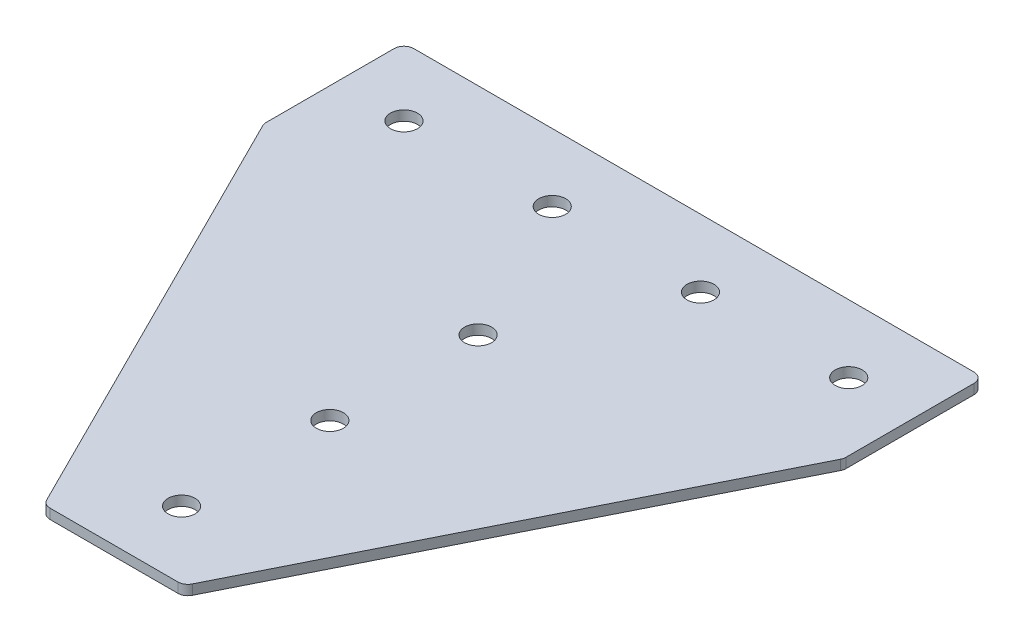
ISO-10303-21;
HEADER;
FILE_DESCRIPTION(('STEP AP214'),'2;1');
FILE_NAME('part.step','',(''),(''),'','','');
FILE_SCHEMA(('AUTOMOTIVE_DESIGN { 1 0 10303 214 1 1 1 1 }'));
ENDSEC;
DATA;
#1=APPLICATION_CONTEXT('core data for automotive mechanical design processes');
#2=APPLICATION_PROTOCOL_DEFINITION('international standard','automotive_design',2000,#1);
#3=PRODUCT_CONTEXT('',#1,'mechanical');
#4=PRODUCT('Part','Part','',(#3));
#5=PRODUCT_RELATED_PRODUCT_CATEGORY('part','',(#4));
#6=PRODUCT_DEFINITION_FORMATION('','',#4);
#7=PRODUCT_DEFINITION_CONTEXT('part definition',#1,'design');
#8=PRODUCT_DEFINITION('design','',#6,#7);
#9=PRODUCT_DEFINITION_SHAPE('','',#8);
#10=(LENGTH_UNIT() NAMED_UNIT(*) SI_UNIT(.MILLI.,.METRE.));
#11=(NAMED_UNIT(*) PLANE_ANGLE_UNIT() SI_UNIT($,.RADIAN.));
#12=(NAMED_UNIT(*) SI_UNIT($,.STERADIAN.) SOLID_ANGLE_UNIT());
#13=UNCERTAINTY_MEASURE_WITH_UNIT(LENGTH_MEASURE(1.E-05),#10,'distance_accuracy_value','');
#14=(GEOMETRIC_REPRESENTATION_CONTEXT(3) GLOBAL_UNCERTAINTY_ASSIGNED_CONTEXT((#13)) GLOBAL_UNIT_ASSIGNED_CONTEXT((#10,
#11,#12)) REPRESENTATION_CONTEXT('',''));
#15=CARTESIAN_POINT('',(0.,0.,0.));
#16=DIRECTION('',(0.,0.,1.));
#17=DIRECTION('',(1.,0.,0.));
#18=AXIS2_PLACEMENT_3D('',#15,#16,#17);
#19=CARTESIAN_POINT('',(-1.93702400832763,1.42462627726309,-68.4871269738255));
#20=DIRECTION('',(0.,-1.,0.));
#21=DIRECTION('',(0.,0.,-1.));
#22=AXIS2_PLACEMENT_3D('',#19,#20,#21);
#23=PLANE('',#22);
#24=CARTESIAN_POINT('',(-1.93702400832764,1.42462627726309,-23.4871269738255));
#25=DIRECTION('',(0.,1.,0.));
#26=DIRECTION('',(0.,0.,1.));
#27=AXIS2_PLACEMENT_3D('',#24,#25,#26);
#28=CIRCLE('',#27,4.1);
#29=CARTESIAN_POINT('',(-1.93702400832764,1.42462627726309,-19.3871269738255));
#30=VERTEX_POINT('',#29);
#31=EDGE_CURVE('E183',#30,#30,#28,.T.);
#32=ORIENTED_EDGE('',*,*,#31,.T.);
#33=EDGE_LOOP('',(#32));
#34=FACE_BOUND('',#33,.T.);
#35=DIRECTION('',(1.,0.,0.));
#36=VECTOR('',#35,1.);
#37=CARTESIAN_POINT('',(-22.4370240083276,1.42462627726309,87.0128730261745));
#38=LINE('',#37,#36);
#39=CARTESIAN_POINT('',(-21.3468540645781,1.42462627726309,87.0128730261745));
#40=VERTEX_POINT('',#39);
#41=CARTESIAN_POINT('',(17.4728060479229,1.42462627726309,87.0128730261745));
#42=VERTEX_POINT('',#41);
#43=EDGE_CURVE('E201',#40,#42,#38,.T.);
#44=ORIENTED_EDGE('',*,*,#43,.F.);
#45=CARTESIAN_POINT('',(-21.3468540645781,1.42462627726309,84.0128730261745));
#46=DIRECTION('',(0.,1.,0.));
#47=DIRECTION('',(0.,0.,-1.));
#48=AXIS2_PLACEMENT_3D('',#45,#46,#47);
#49=CIRCLE('',#48,3.);
#50=CARTESIAN_POINT('',(-24.0301356375779,1.42462627726309,85.3545138126744));
#51=VERTEX_POINT('',#50);
#52=EDGE_CURVE('E155',#51,#40,#49,.T.);
#53=ORIENTED_EDGE('',*,*,#52,.F.);
#54=DIRECTION('',(-0.447213595499958,0.,-0.894427190999916));
#55=VECTOR('',#54,1.);
#56=CARTESIAN_POINT('',(-23.2009560308278,1.42462627726309,87.0128730261745));
#57=LINE('',#56,#55);
#58=CARTESIAN_POINT('',(-89.6203055813274,1.42462627726309,-45.8258260748245));
#59=VERTEX_POINT('',#58);
#60=EDGE_CURVE('E142',#51,#59,#57,.T.);
#61=ORIENTED_EDGE('',*,*,#60,.T.);
#62=CARTESIAN_POINT('',(-86.9370240083276,1.42462627726309,-47.1674668613244));
#63=DIRECTION('',(0.,1.,0.));
#64=DIRECTION('',(0.,0.,-1.));
#65=AXIS2_PLACEMENT_3D('',#62,#63,#64);
#66=CIRCLE('',#65,3.);
#67=CARTESIAN_POINT('',(-89.9370240083277,1.42462627726309,-47.1674668613244));
#68=VERTEX_POINT('',#67);
#69=EDGE_CURVE('E153',#68,#59,#66,.T.);
#70=ORIENTED_EDGE('',*,*,#69,.F.);
#71=DIRECTION('',(0.,0.,-1.));
#72=VECTOR('',#71,1.);
#73=CARTESIAN_POINT('',(-89.9370240083277,1.42462627726309,-46.4592629288251));
#74=LINE('',#73,#72);
#75=CARTESIAN_POINT('',(-89.9370240083277,1.42462627726309,-85.9871269738255));
#76=VERTEX_POINT('',#75);
#77=EDGE_CURVE('E124',#68,#76,#74,.T.);
#78=ORIENTED_EDGE('',*,*,#77,.T.);
#79=CARTESIAN_POINT('',(-86.9370240083276,1.42462627726309,-85.9871269738255));
#80=DIRECTION('',(0.,1.,0.));
#81=DIRECTION('',(0.,0.,-1.));
#82=AXIS2_PLACEMENT_3D('',#79,#80,#81);
#83=CIRCLE('',#82,3.);
#84=CARTESIAN_POINT('',(-86.9370240083276,1.42462627726309,-88.9871269738255));
#85=VERTEX_POINT('',#84);
#86=EDGE_CURVE('E150',#85,#76,#83,.T.);
#87=ORIENTED_EDGE('',*,*,#86,.F.);
#88=DIRECTION('',(-1.,0.,0.));
#89=VECTOR('',#88,1.);
#90=CARTESIAN_POINT('',(86.0629759916724,1.42462627726309,-88.9871269738255));
#91=LINE('',#90,#89);
#92=CARTESIAN_POINT('',(83.0629759916724,1.42462627726309,-88.9871269738255));
#93=VERTEX_POINT('',#92);
#94=EDGE_CURVE('E198',#93,#85,#91,.T.);
#95=ORIENTED_EDGE('',*,*,#94,.F.);
#96=CARTESIAN_POINT('',(83.0629759916724,1.42462627726309,-85.9871269738255));
#97=DIRECTION('',(0.,-1.,0.));
#98=DIRECTION('',(0.,0.,-1.));
#99=AXIS2_PLACEMENT_3D('',#96,#97,#98);
#100=CIRCLE('',#99,3.);
#101=CARTESIAN_POINT('',(86.0629759916724,1.42462627726309,-85.9871269738255));
#102=VERTEX_POINT('',#101);
#103=EDGE_CURVE('E222',#93,#102,#100,.T.);
#104=ORIENTED_EDGE('',*,*,#103,.T.);
#105=DIRECTION('',(0.,0.,-1.));
#106=VECTOR('',#105,1.);
#107=CARTESIAN_POINT('',(86.0629759916724,1.42462627726309,-46.4592629288251));
#108=LINE('',#107,#106);
#109=CARTESIAN_POINT('',(86.0629759916724,1.42462627726309,-47.1674668613244));
#110=VERTEX_POINT('',#109);
#111=EDGE_CURVE('E195',#110,#102,#108,.T.);
#112=ORIENTED_EDGE('',*,*,#111,.F.);
#113=CARTESIAN_POINT('',(83.0629759916724,1.42462627726309,-47.1674668613244));
#114=DIRECTION('',(0.,-1.,0.));
#115=DIRECTION('',(0.,0.,-1.));
#116=AXIS2_PLACEMENT_3D('',#113,#114,#115);
#117=CIRCLE('',#116,3.);
#118=CARTESIAN_POINT('',(85.7462575646721,1.42462627726309,-45.8258260748245));
#119=VERTEX_POINT('',#118);
#120=EDGE_CURVE('E31',#110,#119,#117,.T.);
#121=ORIENTED_EDGE('',*,*,#120,.T.);
#122=DIRECTION('',(0.447213595499958,0.,-0.894427190999916));
#123=VECTOR('',#122,1.);
#124=CARTESIAN_POINT('',(19.3269080141726,1.42462627726309,87.0128730261745));
#125=LINE('',#124,#123);
#126=CARTESIAN_POINT('',(20.1560876209226,1.42462627726309,85.3545138126744));
#127=VERTEX_POINT('',#126);
#128=EDGE_CURVE('E203',#127,#119,#125,.T.);
#129=ORIENTED_EDGE('',*,*,#128,.F.);
#130=CARTESIAN_POINT('',(17.4728060479229,1.42462627726309,84.0128730261745));
#131=DIRECTION('',(0.,-1.,0.));
#132=DIRECTION('',(0.,0.,-1.));
#133=AXIS2_PLACEMENT_3D('',#130,#131,#132);
#134=CIRCLE('',#133,3.);
#135=EDGE_CURVE('E225',#127,#42,#134,.T.);
#136=ORIENTED_EDGE('',*,*,#135,.T.);
#137=EDGE_LOOP('',(#44,#53,#61,#70,#78,#87,#95,#104,#112,#121,#129,#136));
#138=FACE_BOUND('',#137,.T.);
#139=CARTESIAN_POINT('',(-1.93702400832764,1.42462627726309,66.5128730261745));
#140=DIRECTION('',(0.,1.,0.));
#141=DIRECTION('',(0.,0.,1.));
#142=AXIS2_PLACEMENT_3D('',#139,#140,#141);
#143=CIRCLE('',#142,4.1);
#144=CARTESIAN_POINT('',(-1.93702400832764,1.42462627726309,70.6128730261745));
#145=VERTEX_POINT('',#144);
#146=EDGE_CURVE('E171',#145,#145,#143,.T.);
#147=ORIENTED_EDGE('',*,*,#146,.T.);
#148=EDGE_LOOP('',(#147));
#149=FACE_BOUND('',#148,.T.);
#150=CARTESIAN_POINT('',(-1.93702400832764,1.42462627726309,21.5128730261745));
#151=DIRECTION('',(0.,1.,0.));
#152=DIRECTION('',(0.,0.,1.));
#153=AXIS2_PLACEMENT_3D('',#150,#151,#152);
#154=CIRCLE('',#153,4.1);
#155=CARTESIAN_POINT('',(-1.93702400832764,1.42462627726309,25.6128730261745));
#156=VERTEX_POINT('',#155);
#157=EDGE_CURVE('E177',#156,#156,#154,.T.);
#158=ORIENTED_EDGE('',*,*,#157,.T.);
#159=EDGE_LOOP('',(#158));
#160=FACE_BOUND('',#159,.T.);
#161=CARTESIAN_POINT('',(65.5629759916724,1.42462627726309,-68.4871269738255));
#162=DIRECTION('',(0.,1.,0.));
#163=DIRECTION('',(0.,0.,1.));
#164=AXIS2_PLACEMENT_3D('',#161,#162,#163);
#165=CIRCLE('',#164,4.09999999999999);
#166=CARTESIAN_POINT('',(65.5629759916724,1.42462627726309,-64.3871269738255));
#167=VERTEX_POINT('',#166);
#168=EDGE_CURVE('E165',#167,#167,#165,.T.);
#169=ORIENTED_EDGE('',*,*,#168,.T.);
#170=EDGE_LOOP('',(#169));
#171=FACE_BOUND('',#170,.T.);
#172=CARTESIAN_POINT('',(20.5629759916724,1.42462627726309,-68.4871269738255));
#173=DIRECTION('',(0.,1.,0.));
#174=DIRECTION('',(0.,0.,1.));
#175=AXIS2_PLACEMENT_3D('',#172,#173,#174);
#176=CIRCLE('',#175,4.1);
#177=CARTESIAN_POINT('',(20.5629759916724,1.42462627726309,-64.3871269738255));
#178=VERTEX_POINT('',#177);
#179=EDGE_CURVE('E189',#178,#178,#176,.T.);
#180=ORIENTED_EDGE('',*,*,#179,.T.);
#181=EDGE_LOOP('',(#180));
#182=FACE_BOUND('',#181,.T.);
#183=CARTESIAN_POINT('',(-69.4370240083276,1.42462627726309,-68.4871269738255));
#184=DIRECTION('',(0.,-1.,0.));
#185=DIRECTION('',(0.,0.,1.));
#186=AXIS2_PLACEMENT_3D('',#183,#184,#185);
#187=CIRCLE('',#186,4.09999999999999);
#188=CARTESIAN_POINT('',(-69.4370240083276,1.42462627726309,-64.3871269738255));
#189=VERTEX_POINT('',#188);
#190=EDGE_CURVE('E265',#189,#189,#187,.T.);
#191=ORIENTED_EDGE('',*,*,#190,.F.);
#192=EDGE_LOOP('',(#191));
#193=FACE_BOUND('',#192,.T.);
#194=CARTESIAN_POINT('',(-24.4370240083276,1.42462627726309,-68.4871269738255));
#195=DIRECTION('',(0.,-1.,0.));
#196=DIRECTION('',(0.,0.,1.));
#197=AXIS2_PLACEMENT_3D('',#194,#195,#196);
#198=CIRCLE('',#197,4.1);
#199=CARTESIAN_POINT('',(-24.4370240083276,1.42462627726309,-64.3871269738255));
#200=VERTEX_POINT('',#199);
#201=EDGE_CURVE('E135',#200,#200,#198,.T.);
#202=ORIENTED_EDGE('',*,*,#201,.F.);
#203=EDGE_LOOP('',(#202));
#204=FACE_BOUND('',#203,.T.);
#205=ADVANCED_FACE('F16',(#34,#138,#149,#160,#171,#182,#193,#204),#23,.T.);
#206=CARTESIAN_POINT('',(86.0629759916724,1.42462627726309,-46.4592629288251));
#207=DIRECTION('',(1.,0.,0.));
#208=DIRECTION('',(0.,0.,-1.));
#209=AXIS2_PLACEMENT_3D('',#206,#207,#208);
#210=PLANE('',#209);
#211=DIRECTION('',(0.,0.,-1.));
#212=VECTOR('',#211,1.);
#213=CARTESIAN_POINT('',(86.0629759916724,4.42462627726309,-46.4592629288251));
#214=LINE('',#213,#212);
#215=CARTESIAN_POINT('',(86.0629759916724,4.42462627726309,-47.1674668613244));
#216=VERTEX_POINT('',#215);
#217=CARTESIAN_POINT('',(86.0629759916724,4.42462627726309,-85.9871269738255));
#218=VERTEX_POINT('',#217);
#219=EDGE_CURVE('E192',#216,#218,#214,.T.);
#220=ORIENTED_EDGE('',*,*,#219,.F.);
#221=DIRECTION('',(0.,1.,0.));
#222=VECTOR('',#221,1.);
#223=CARTESIAN_POINT('',(86.0629759916724,1.42462627726309,-47.1674668613244));
#224=LINE('',#223,#222);
#225=EDGE_CURVE('E24',#216,#110,#224,.F.);
#226=ORIENTED_EDGE('',*,*,#225,.T.);
#227=ORIENTED_EDGE('',*,*,#111,.T.);
#228=DIRECTION('',(0.,1.,0.));
#229=VECTOR('',#228,1.);
#230=CARTESIAN_POINT('',(86.0629759916724,1.42462627726309,-85.9871269738255));
#231=LINE('',#230,#229);
#232=EDGE_CURVE('E232',#102,#218,#231,.T.);
#233=ORIENTED_EDGE('',*,*,#232,.T.);
#234=EDGE_LOOP('',(#220,#226,#227,#233));
#235=FACE_BOUND('',#234,.T.);
#236=ADVANCED_FACE('F237',(#235),#210,.T.);
#237=CARTESIAN_POINT('',(19.3269080141726,1.42462627726309,87.0128730261745));
#238=DIRECTION('',(0.894427190999916,0.,0.447213595499958));
#239=DIRECTION('',(0.447213595499958,0.,-0.894427190999916));
#240=AXIS2_PLACEMENT_3D('',#237,#238,#239);
#241=PLANE('',#240);
#242=DIRECTION('',(0.447213595499958,0.,-0.894427190999916));
#243=VECTOR('',#242,1.);
#244=CARTESIAN_POINT('',(19.3269080141726,4.42462627726309,87.0128730261745));
#245=LINE('',#244,#243);
#246=CARTESIAN_POINT('',(20.1560876209226,4.42462627726309,85.3545138126744));
#247=VERTEX_POINT('',#246);
#248=CARTESIAN_POINT('',(85.7462575646721,4.42462627726309,-45.8258260748245));
#249=VERTEX_POINT('',#248);
#250=EDGE_CURVE('E199',#247,#249,#245,.T.);
#251=ORIENTED_EDGE('',*,*,#250,.F.);
#252=DIRECTION('',(0.,1.,0.));
#253=VECTOR('',#252,1.);
#254=CARTESIAN_POINT('',(20.1560876209226,1.42462627726309,85.3545138126744));
#255=LINE('',#254,#253);
#256=EDGE_CURVE('E38',#247,#127,#255,.F.);
#257=ORIENTED_EDGE('',*,*,#256,.T.);
#258=ORIENTED_EDGE('',*,*,#128,.T.);
#259=DIRECTION('',(0.,1.,0.));
#260=VECTOR('',#259,1.);
#261=CARTESIAN_POINT('',(85.7462575646721,1.42462627726309,-45.8258260748245));
#262=LINE('',#261,#260);
#263=EDGE_CURVE('E228',#119,#249,#262,.T.);
#264=ORIENTED_EDGE('',*,*,#263,.T.);
#265=EDGE_LOOP('',(#251,#257,#258,#264));
#266=FACE_BOUND('',#265,.T.);
#267=ADVANCED_FACE('F245',(#266),#241,.T.);
#268=CARTESIAN_POINT('',(-22.4370240083276,1.42462627726309,87.0128730261745));
#269=DIRECTION('',(0.,0.,1.));
#270=DIRECTION('',(1.,0.,0.));
#271=AXIS2_PLACEMENT_3D('',#268,#269,#270);
#272=PLANE('',#271);
#273=DIRECTION('',(1.,0.,0.));
#274=VECTOR('',#273,1.);
#275=CARTESIAN_POINT('',(-22.4370240083276,4.42462627726309,87.0128730261745));
#276=LINE('',#275,#274);
#277=CARTESIAN_POINT('',(-21.3468540645781,4.42462627726309,87.0128730261745));
#278=VERTEX_POINT('',#277);
#279=CARTESIAN_POINT('',(17.4728060479229,4.42462627726309,87.0128730261745));
#280=VERTEX_POINT('',#279);
#281=EDGE_CURVE('E210',#278,#280,#276,.T.);
#282=ORIENTED_EDGE('',*,*,#281,.F.);
#283=DIRECTION('',(0.,1.,0.));
#284=VECTOR('',#283,1.);
#285=CARTESIAN_POINT('',(-21.3468540645781,1.42462627726309,87.0128730261745));
#286=LINE('',#285,#284);
#287=EDGE_CURVE('E147',#40,#278,#286,.T.);
#288=ORIENTED_EDGE('',*,*,#287,.F.);
#289=ORIENTED_EDGE('',*,*,#43,.T.);
#290=DIRECTION('',(0.,1.,0.));
#291=VECTOR('',#290,1.);
#292=CARTESIAN_POINT('',(17.4728060479229,1.42462627726309,87.0128730261745));
#293=LINE('',#292,#291);
#294=EDGE_CURVE('E219',#42,#280,#293,.T.);
#295=ORIENTED_EDGE('',*,*,#294,.T.);
#296=EDGE_LOOP('',(#282,#288,#289,#295));
#297=FACE_BOUND('',#296,.T.);
#298=ADVANCED_FACE('F252',(#297),#272,.T.);
#299=CARTESIAN_POINT('',(86.0629759916724,1.42462627726309,-88.9871269738255));
#300=DIRECTION('',(0.,0.,-1.));
#301=DIRECTION('',(-1.,0.,0.));
#302=AXIS2_PLACEMENT_3D('',#299,#300,#301);
#303=PLANE('',#302);
#304=ORIENTED_EDGE('',*,*,#94,.T.);
#305=DIRECTION('',(0.,1.,0.));
#306=VECTOR('',#305,1.);
#307=CARTESIAN_POINT('',(-86.9370240083276,1.42462627726309,-88.9871269738255));
#308=LINE('',#307,#306);
#309=CARTESIAN_POINT('',(-86.9370240083276,4.42462627726309,-88.9871269738255));
#310=VERTEX_POINT('',#309);
#311=EDGE_CURVE('E126',#310,#85,#308,.F.);
#312=ORIENTED_EDGE('',*,*,#311,.F.);
#313=DIRECTION('',(-1.,0.,0.));
#314=VECTOR('',#313,1.);
#315=CARTESIAN_POINT('',(86.0629759916724,4.42462627726309,-88.9871269738255));
#316=LINE('',#315,#314);
#317=CARTESIAN_POINT('',(83.0629759916724,4.42462627726309,-88.9871269738255));
#318=VERTEX_POINT('',#317);
#319=EDGE_CURVE('E208',#318,#310,#316,.T.);
#320=ORIENTED_EDGE('',*,*,#319,.F.);
#321=DIRECTION('',(0.,1.,0.));
#322=VECTOR('',#321,1.);
#323=CARTESIAN_POINT('',(83.0629759916724,1.42462627726309,-88.9871269738255));
#324=LINE('',#323,#322);
#325=EDGE_CURVE('E10',#318,#93,#324,.F.);
#326=ORIENTED_EDGE('',*,*,#325,.T.);
#327=EDGE_LOOP('',(#304,#312,#320,#326));
#328=FACE_BOUND('',#327,.T.);
#329=ADVANCED_FACE('F290',(#328),#303,.T.);
#330=CARTESIAN_POINT('',(-1.93702400832763,4.42462627726309,-68.4871269738255));
#331=DIRECTION('',(0.,-1.,0.));
#332=DIRECTION('',(0.,0.,-1.));
#333=AXIS2_PLACEMENT_3D('',#330,#331,#332);
#334=PLANE('',#333);
#335=CARTESIAN_POINT('',(-1.93702400832764,4.42462627726309,-23.4871269738255));
#336=DIRECTION('',(0.,1.,0.));
#337=DIRECTION('',(0.,0.,1.));
#338=AXIS2_PLACEMENT_3D('',#335,#336,#337);
#339=CIRCLE('',#338,4.1);
#340=CARTESIAN_POINT('',(-1.93702400832764,4.42462627726309,-19.3871269738255));
#341=VERTEX_POINT('',#340);
#342=EDGE_CURVE('E180',#341,#341,#339,.T.);
#343=ORIENTED_EDGE('',*,*,#342,.F.);
#344=EDGE_LOOP('',(#343));
#345=FACE_BOUND('',#344,.T.);
#346=CARTESIAN_POINT('',(-21.3468540645781,4.42462627726309,84.0128730261745));
#347=DIRECTION('',(0.,1.,0.));
#348=DIRECTION('',(0.,0.,-1.));
#349=AXIS2_PLACEMENT_3D('',#346,#347,#348);
#350=CIRCLE('',#349,3.);
#351=CARTESIAN_POINT('',(-24.0301356375779,4.42462627726309,85.3545138126744));
#352=VERTEX_POINT('',#351);
#353=EDGE_CURVE('E116',#278,#352,#350,.F.);
#354=ORIENTED_EDGE('',*,*,#353,.F.);
#355=ORIENTED_EDGE('',*,*,#281,.T.);
#356=CARTESIAN_POINT('',(17.4728060479229,4.42462627726309,84.0128730261745));
#357=DIRECTION('',(0.,-1.,0.));
#358=DIRECTION('',(0.,0.,-1.));
#359=AXIS2_PLACEMENT_3D('',#356,#357,#358);
#360=CIRCLE('',#359,3.);
#361=EDGE_CURVE('E217',#280,#247,#360,.F.);
#362=ORIENTED_EDGE('',*,*,#361,.T.);
#363=ORIENTED_EDGE('',*,*,#250,.T.);
#364=CARTESIAN_POINT('',(83.0629759916724,4.42462627726309,-47.1674668613244));
#365=DIRECTION('',(0.,-1.,0.));
#366=DIRECTION('',(0.,0.,-1.));
#367=AXIS2_PLACEMENT_3D('',#364,#365,#366);
#368=CIRCLE('',#367,3.);
#369=EDGE_CURVE('E215',#249,#216,#368,.F.);
#370=ORIENTED_EDGE('',*,*,#369,.T.);
#371=ORIENTED_EDGE('',*,*,#219,.T.);
#372=CARTESIAN_POINT('',(83.0629759916724,4.42462627726309,-85.9871269738255));
#373=DIRECTION('',(0.,-1.,0.));
#374=DIRECTION('',(0.,0.,-1.));
#375=AXIS2_PLACEMENT_3D('',#372,#373,#374);
#376=CIRCLE('',#375,3.);
#377=EDGE_CURVE('E205',#218,#318,#376,.F.);
#378=ORIENTED_EDGE('',*,*,#377,.T.);
#379=ORIENTED_EDGE('',*,*,#319,.T.);
#380=CARTESIAN_POINT('',(-86.9370240083276,4.42462627726309,-85.9871269738255));
#381=DIRECTION('',(0.,1.,0.));
#382=DIRECTION('',(0.,0.,-1.));
#383=AXIS2_PLACEMENT_3D('',#380,#381,#382);
#384=CIRCLE('',#383,3.);
#385=CARTESIAN_POINT('',(-89.9370240083277,4.42462627726309,-85.9871269738255));
#386=VERTEX_POINT('',#385);
#387=EDGE_CURVE('E117',#386,#310,#384,.F.);
#388=ORIENTED_EDGE('',*,*,#387,.F.);
#389=DIRECTION('',(0.,0.,-1.));
#390=VECTOR('',#389,1.);
#391=CARTESIAN_POINT('',(-89.9370240083277,4.42462627726309,-46.4592629288251));
#392=LINE('',#391,#390);
#393=CARTESIAN_POINT('',(-89.9370240083277,4.42462627726309,-47.1674668613244));
#394=VERTEX_POINT('',#393);
#395=EDGE_CURVE('E122',#394,#386,#392,.T.);
#396=ORIENTED_EDGE('',*,*,#395,.F.);
#397=CARTESIAN_POINT('',(-86.9370240083276,4.42462627726309,-47.1674668613244));
#398=DIRECTION('',(0.,1.,0.));
#399=DIRECTION('',(0.,0.,-1.));
#400=AXIS2_PLACEMENT_3D('',#397,#398,#399);
#401=CIRCLE('',#400,3.);
#402=CARTESIAN_POINT('',(-89.6203055813274,4.42462627726309,-45.8258260748245));
#403=VERTEX_POINT('',#402);
#404=EDGE_CURVE('E105',#403,#394,#401,.F.);
#405=ORIENTED_EDGE('',*,*,#404,.F.);
#406=DIRECTION('',(-0.447213595499958,0.,-0.894427190999916));
#407=VECTOR('',#406,1.);
#408=CARTESIAN_POINT('',(-23.2009560308278,4.42462627726309,87.0128730261745));
#409=LINE('',#408,#407);
#410=EDGE_CURVE('E134',#352,#403,#409,.T.);
#411=ORIENTED_EDGE('',*,*,#410,.F.);
#412=EDGE_LOOP('',(#354,#355,#362,#363,#370,#371,#378,#379,#388,#396,#405,#411));
#413=FACE_BOUND('',#412,.T.);
#414=CARTESIAN_POINT('',(-1.93702400832764,4.42462627726309,66.5128730261745));
#415=DIRECTION('',(0.,1.,0.));
#416=DIRECTION('',(0.,0.,1.));
#417=AXIS2_PLACEMENT_3D('',#414,#415,#416);
#418=CIRCLE('',#417,4.1);
#419=CARTESIAN_POINT('',(-1.93702400832764,4.42462627726309,70.6128730261745));
#420=VERTEX_POINT('',#419);
#421=EDGE_CURVE('E168',#420,#420,#418,.T.);
#422=ORIENTED_EDGE('',*,*,#421,.F.);
#423=EDGE_LOOP('',(#422));
#424=FACE_BOUND('',#423,.T.);
#425=CARTESIAN_POINT('',(65.5629759916724,4.42462627726309,-68.4871269738255));
#426=DIRECTION('',(0.,1.,0.));
#427=DIRECTION('',(0.,0.,1.));
#428=AXIS2_PLACEMENT_3D('',#425,#426,#427);
#429=CIRCLE('',#428,4.09999999999999);
#430=CARTESIAN_POINT('',(65.5629759916724,4.42462627726309,-64.3871269738255));
#431=VERTEX_POINT('',#430);
#432=EDGE_CURVE('E164',#431,#431,#429,.T.);
#433=ORIENTED_EDGE('',*,*,#432,.F.);
#434=EDGE_LOOP('',(#433));
#435=FACE_BOUND('',#434,.T.);
#436=CARTESIAN_POINT('',(-1.93702400832764,4.42462627726309,21.5128730261745));
#437=DIRECTION('',(0.,1.,0.));
#438=DIRECTION('',(0.,0.,1.));
#439=AXIS2_PLACEMENT_3D('',#436,#437,#438);
#440=CIRCLE('',#439,4.1);
#441=CARTESIAN_POINT('',(-1.93702400832764,4.42462627726309,25.6128730261745));
#442=VERTEX_POINT('',#441);
#443=EDGE_CURVE('E174',#442,#442,#440,.T.);
#444=ORIENTED_EDGE('',*,*,#443,.F.);
#445=EDGE_LOOP('',(#444));
#446=FACE_BOUND('',#445,.T.);
#447=CARTESIAN_POINT('',(20.5629759916724,4.42462627726309,-68.4871269738255));
#448=DIRECTION('',(0.,1.,0.));
#449=DIRECTION('',(0.,0.,1.));
#450=AXIS2_PLACEMENT_3D('',#447,#448,#449);
#451=CIRCLE('',#450,4.1);
#452=CARTESIAN_POINT('',(20.5629759916724,4.42462627726309,-64.3871269738255));
#453=VERTEX_POINT('',#452);
#454=EDGE_CURVE('E186',#453,#453,#451,.T.);
#455=ORIENTED_EDGE('',*,*,#454,.F.);
#456=EDGE_LOOP('',(#455));
#457=FACE_BOUND('',#456,.T.);
#458=CARTESIAN_POINT('',(-69.4370240083276,4.42462627726309,-68.4871269738255));
#459=DIRECTION('',(0.,-1.,0.));
#460=DIRECTION('',(0.,0.,1.));
#461=AXIS2_PLACEMENT_3D('',#458,#459,#460);
#462=CIRCLE('',#461,4.09999999999999);
#463=CARTESIAN_POINT('',(-69.4370240083276,4.42462627726309,-64.3871269738255));
#464=VERTEX_POINT('',#463);
#465=EDGE_CURVE('E267',#464,#464,#462,.T.);
#466=ORIENTED_EDGE('',*,*,#465,.T.);
#467=EDGE_LOOP('',(#466));
#468=FACE_BOUND('',#467,.T.);
#469=CARTESIAN_POINT('',(-24.4370240083276,4.42462627726309,-68.4871269738255));
#470=DIRECTION('',(0.,-1.,0.));
#471=DIRECTION('',(0.,0.,1.));
#472=AXIS2_PLACEMENT_3D('',#469,#470,#471);
#473=CIRCLE('',#472,4.1);
#474=CARTESIAN_POINT('',(-24.4370240083276,4.42462627726309,-64.3871269738255));
#475=VERTEX_POINT('',#474);
#476=EDGE_CURVE('E139',#475,#475,#473,.T.);
#477=ORIENTED_EDGE('',*,*,#476,.T.);
#478=EDGE_LOOP('',(#477));
#479=FACE_BOUND('',#478,.T.);
#480=ADVANCED_FACE('F130',(#345,#413,#424,#435,#446,#457,#468,#479),#334,.F.);
#481=CARTESIAN_POINT('',(17.4728060479229,1.42462627726309,84.0128730261745));
#482=DIRECTION('',(0.,1.,0.));
#483=DIRECTION('',(0.,0.,1.));
#484=AXIS2_PLACEMENT_3D('',#481,#482,#483);
#485=CYLINDRICAL_SURFACE('',#484,3.);
#486=ORIENTED_EDGE('',*,*,#135,.F.);
#487=ORIENTED_EDGE('',*,*,#256,.F.);
#488=ORIENTED_EDGE('',*,*,#361,.F.);
#489=ORIENTED_EDGE('',*,*,#294,.F.);
#490=EDGE_LOOP('',(#486,#487,#488,#489));
#491=FACE_BOUND('',#490,.T.);
#492=ADVANCED_FACE('F250',(#491),#485,.T.);
#493=CARTESIAN_POINT('',(83.0629759916724,1.42462627726309,-47.1674668613244));
#494=DIRECTION('',(0.,1.,0.));
#495=DIRECTION('',(0.,0.,1.));
#496=AXIS2_PLACEMENT_3D('',#493,#494,#495);
#497=CYLINDRICAL_SURFACE('',#496,3.);
#498=ORIENTED_EDGE('',*,*,#120,.F.);
#499=ORIENTED_EDGE('',*,*,#225,.F.);
#500=ORIENTED_EDGE('',*,*,#369,.F.);
#501=ORIENTED_EDGE('',*,*,#263,.F.);
#502=EDGE_LOOP('',(#498,#499,#500,#501));
#503=FACE_BOUND('',#502,.T.);
#504=ADVANCED_FACE('F244',(#503),#497,.T.);
#505=CARTESIAN_POINT('',(83.0629759916724,1.42462627726309,-85.9871269738255));
#506=DIRECTION('',(0.,1.,0.));
#507=DIRECTION('',(0.,0.,1.));
#508=AXIS2_PLACEMENT_3D('',#505,#506,#507);
#509=CYLINDRICAL_SURFACE('',#508,3.);
#510=ORIENTED_EDGE('',*,*,#103,.F.);
#511=ORIENTED_EDGE('',*,*,#325,.F.);
#512=ORIENTED_EDGE('',*,*,#377,.F.);
#513=ORIENTED_EDGE('',*,*,#232,.F.);
#514=EDGE_LOOP('',(#510,#511,#512,#513));
#515=FACE_BOUND('',#514,.T.);
#516=ADVANCED_FACE('F18',(#515),#509,.T.);
#517=CARTESIAN_POINT('',(20.5629759916724,1.42462627726309,-68.4871269738255));
#518=DIRECTION('',(0.,1.,0.));
#519=DIRECTION('',(0.,0.,1.));
#520=AXIS2_PLACEMENT_3D('',#517,#518,#519);
#521=CYLINDRICAL_SURFACE('',#520,4.1);
#522=ORIENTED_EDGE('',*,*,#179,.F.);
#523=EDGE_LOOP('',(#522));
#524=FACE_BOUND('',#523,.T.);
#525=ORIENTED_EDGE('',*,*,#454,.T.);
#526=EDGE_LOOP('',(#525));
#527=FACE_BOUND('',#526,.T.);
#528=ADVANCED_FACE('F307',(#524,#527),#521,.F.);
#529=CARTESIAN_POINT('',(-1.93702400832764,1.42462627726309,-23.4871269738255));
#530=DIRECTION('',(0.,1.,0.));
#531=DIRECTION('',(0.,0.,1.));
#532=AXIS2_PLACEMENT_3D('',#529,#530,#531);
#533=CYLINDRICAL_SURFACE('',#532,4.1);
#534=ORIENTED_EDGE('',*,*,#31,.F.);
#535=EDGE_LOOP('',(#534));
#536=FACE_BOUND('',#535,.T.);
#537=ORIENTED_EDGE('',*,*,#342,.T.);
#538=EDGE_LOOP('',(#537));
#539=FACE_BOUND('',#538,.T.);
#540=ADVANCED_FACE('F312',(#536,#539),#533,.F.);
#541=CARTESIAN_POINT('',(-1.93702400832764,1.42462627726309,21.5128730261745));
#542=DIRECTION('',(0.,1.,0.));
#543=DIRECTION('',(0.,0.,1.));
#544=AXIS2_PLACEMENT_3D('',#541,#542,#543);
#545=CYLINDRICAL_SURFACE('',#544,4.1);
#546=ORIENTED_EDGE('',*,*,#443,.T.);
#547=EDGE_LOOP('',(#546));
#548=FACE_BOUND('',#547,.T.);
#549=ORIENTED_EDGE('',*,*,#157,.F.);
#550=EDGE_LOOP('',(#549));
#551=FACE_BOUND('',#550,.T.);
#552=ADVANCED_FACE('F334',(#548,#551),#545,.F.);
#553=CARTESIAN_POINT('',(-1.93702400832764,1.42462627726309,66.5128730261745));
#554=DIRECTION('',(0.,1.,0.));
#555=DIRECTION('',(0.,0.,1.));
#556=AXIS2_PLACEMENT_3D('',#553,#554,#555);
#557=CYLINDRICAL_SURFACE('',#556,4.1);
#558=ORIENTED_EDGE('',*,*,#421,.T.);
#559=EDGE_LOOP('',(#558));
#560=FACE_BOUND('',#559,.T.);
#561=ORIENTED_EDGE('',*,*,#146,.F.);
#562=EDGE_LOOP('',(#561));
#563=FACE_BOUND('',#562,.T.);
#564=ADVANCED_FACE('F330',(#560,#563),#557,.F.);
#565=CARTESIAN_POINT('',(65.5629759916724,1.42462627726309,-68.4871269738255));
#566=DIRECTION('',(0.,1.,0.));
#567=DIRECTION('',(0.,0.,1.));
#568=AXIS2_PLACEMENT_3D('',#565,#566,#567);
#569=CYLINDRICAL_SURFACE('',#568,4.09999999999999);
#570=ORIENTED_EDGE('',*,*,#168,.F.);
#571=EDGE_LOOP('',(#570));
#572=FACE_BOUND('',#571,.T.);
#573=ORIENTED_EDGE('',*,*,#432,.T.);
#574=EDGE_LOOP('',(#573));
#575=FACE_BOUND('',#574,.T.);
#576=ADVANCED_FACE('F327',(#572,#575),#569,.F.);
#577=CARTESIAN_POINT('',(-89.9370240083277,1.42462627726309,-46.4592629288251));
#578=DIRECTION('',(-1.,0.,0.));
#579=DIRECTION('',(0.,0.,-1.));
#580=AXIS2_PLACEMENT_3D('',#577,#578,#579);
#581=PLANE('',#580);
#582=ORIENTED_EDGE('',*,*,#395,.T.);
#583=DIRECTION('',(0.,1.,0.));
#584=VECTOR('',#583,1.);
#585=CARTESIAN_POINT('',(-89.9370240083277,1.42462627726309,-85.9871269738255));
#586=LINE('',#585,#584);
#587=EDGE_CURVE('E127',#76,#386,#586,.T.);
#588=ORIENTED_EDGE('',*,*,#587,.F.);
#589=ORIENTED_EDGE('',*,*,#77,.F.);
#590=DIRECTION('',(0.,1.,0.));
#591=VECTOR('',#590,1.);
#592=CARTESIAN_POINT('',(-89.9370240083277,1.42462627726309,-47.1674668613244));
#593=LINE('',#592,#591);
#594=EDGE_CURVE('E109',#394,#68,#593,.F.);
#595=ORIENTED_EDGE('',*,*,#594,.F.);
#596=EDGE_LOOP('',(#582,#588,#589,#595));
#597=FACE_BOUND('',#596,.T.);
#598=ADVANCED_FACE('F121',(#597),#581,.T.);
#599=CARTESIAN_POINT('',(-23.2009560308278,1.42462627726309,87.0128730261745));
#600=DIRECTION('',(-0.894427190999916,0.,0.447213595499958));
#601=DIRECTION('',(-0.447213595499958,0.,-0.894427190999916));
#602=AXIS2_PLACEMENT_3D('',#599,#600,#601);
#603=PLANE('',#602);
#604=ORIENTED_EDGE('',*,*,#410,.T.);
#605=DIRECTION('',(0.,1.,0.));
#606=VECTOR('',#605,1.);
#607=CARTESIAN_POINT('',(-89.6203055813274,1.42462627726309,-45.8258260748245));
#608=LINE('',#607,#606);
#609=EDGE_CURVE('E111',#59,#403,#608,.T.);
#610=ORIENTED_EDGE('',*,*,#609,.F.);
#611=ORIENTED_EDGE('',*,*,#60,.F.);
#612=DIRECTION('',(0.,1.,0.));
#613=VECTOR('',#612,1.);
#614=CARTESIAN_POINT('',(-24.0301356375779,1.42462627726309,85.3545138126744));
#615=LINE('',#614,#613);
#616=EDGE_CURVE('E159',#352,#51,#615,.F.);
#617=ORIENTED_EDGE('',*,*,#616,.F.);
#618=EDGE_LOOP('',(#604,#610,#611,#617));
#619=FACE_BOUND('',#618,.T.);
#620=ADVANCED_FACE('F261',(#619),#603,.T.);
#621=CARTESIAN_POINT('',(-21.3468540645781,1.42462627726309,84.0128730261745));
#622=DIRECTION('',(0.,1.,0.));
#623=DIRECTION('',(0.,0.,1.));
#624=AXIS2_PLACEMENT_3D('',#621,#622,#623);
#625=CYLINDRICAL_SURFACE('',#624,3.);
#626=ORIENTED_EDGE('',*,*,#52,.T.);
#627=ORIENTED_EDGE('',*,*,#287,.T.);
#628=ORIENTED_EDGE('',*,*,#353,.T.);
#629=ORIENTED_EDGE('',*,*,#616,.T.);
#630=EDGE_LOOP('',(#626,#627,#628,#629));
#631=FACE_BOUND('',#630,.T.);
#632=ADVANCED_FACE('F258',(#631),#625,.T.);
#633=CARTESIAN_POINT('',(-86.9370240083276,1.42462627726309,-47.1674668613244));
#634=DIRECTION('',(0.,1.,0.));
#635=DIRECTION('',(0.,0.,1.));
#636=AXIS2_PLACEMENT_3D('',#633,#634,#635);
#637=CYLINDRICAL_SURFACE('',#636,3.);
#638=ORIENTED_EDGE('',*,*,#69,.T.);
#639=ORIENTED_EDGE('',*,*,#609,.T.);
#640=ORIENTED_EDGE('',*,*,#404,.T.);
#641=ORIENTED_EDGE('',*,*,#594,.T.);
#642=EDGE_LOOP('',(#638,#639,#640,#641));
#643=FACE_BOUND('',#642,.T.);
#644=ADVANCED_FACE('F108',(#643),#637,.T.);
#645=CARTESIAN_POINT('',(-86.9370240083276,1.42462627726309,-85.9871269738255));
#646=DIRECTION('',(0.,1.,0.));
#647=DIRECTION('',(0.,0.,1.));
#648=AXIS2_PLACEMENT_3D('',#645,#646,#647);
#649=CYLINDRICAL_SURFACE('',#648,3.);
#650=ORIENTED_EDGE('',*,*,#86,.T.);
#651=ORIENTED_EDGE('',*,*,#587,.T.);
#652=ORIENTED_EDGE('',*,*,#387,.T.);
#653=ORIENTED_EDGE('',*,*,#311,.T.);
#654=EDGE_LOOP('',(#650,#651,#652,#653));
#655=FACE_BOUND('',#654,.T.);
#656=ADVANCED_FACE('F285',(#655),#649,.T.);
#657=CARTESIAN_POINT('',(-24.4370240083276,1.42462627726309,-68.4871269738255));
#658=DIRECTION('',(0.,1.,0.));
#659=DIRECTION('',(0.,0.,1.));
#660=AXIS2_PLACEMENT_3D('',#657,#658,#659);
#661=CYLINDRICAL_SURFACE('',#660,4.1);
#662=ORIENTED_EDGE('',*,*,#201,.T.);
#663=EDGE_LOOP('',(#662));
#664=FACE_BOUND('',#663,.T.);
#665=ORIENTED_EDGE('',*,*,#476,.F.);
#666=EDGE_LOOP('',(#665));
#667=FACE_BOUND('',#666,.T.);
#668=ADVANCED_FACE('F282',(#664,#667),#661,.F.);
#669=CARTESIAN_POINT('',(-69.4370240083276,1.42462627726309,-68.4871269738255));
#670=DIRECTION('',(0.,1.,0.));
#671=DIRECTION('',(0.,0.,1.));
#672=AXIS2_PLACEMENT_3D('',#669,#670,#671);
#673=CYLINDRICAL_SURFACE('',#672,4.09999999999999);
#674=ORIENTED_EDGE('',*,*,#190,.T.);
#675=EDGE_LOOP('',(#674));
#676=FACE_BOUND('',#675,.T.);
#677=ORIENTED_EDGE('',*,*,#465,.F.);
#678=EDGE_LOOP('',(#677));
#679=FACE_BOUND('',#678,.T.);
#680=ADVANCED_FACE('F273',(#676,#679),#673,.F.);
#681=CLOSED_SHELL('',(#205,#236,#267,#298,#329,#480,#492,#504,#516,#528,#540,#552,#564,#576,
#598,#620,#632,#644,#656,#668,#680));
#682=MANIFOLD_SOLID_BREP('B1',#681);
#683=ADVANCED_BREP_SHAPE_REPRESENTATION('',(#18,#682),#14);
#684=SHAPE_DEFINITION_REPRESENTATION(#9,#683);
ENDSEC;
END-ISO-10303-21;
